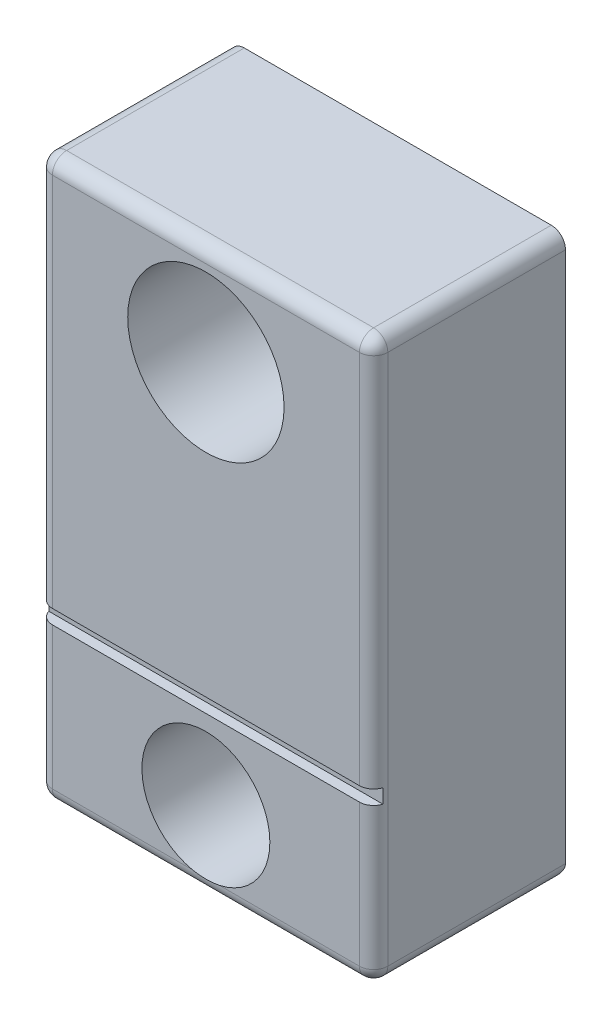
ISO-10303-21;
HEADER;
FILE_DESCRIPTION(('STEP AP214'),'2;1');
FILE_NAME('part.step','',(''),(''),'','','');
FILE_SCHEMA(('AUTOMOTIVE_DESIGN { 1 0 10303 214 1 1 1 1 }'));
ENDSEC;
DATA;
#1=APPLICATION_CONTEXT('core data for automotive mechanical design processes');
#2=APPLICATION_PROTOCOL_DEFINITION('international standard','automotive_design',2000,#1);
#3=PRODUCT_CONTEXT('',#1,'mechanical');
#4=PRODUCT('Part','Part','',(#3));
#5=PRODUCT_RELATED_PRODUCT_CATEGORY('part','',(#4));
#6=PRODUCT_DEFINITION_FORMATION('','',#4);
#7=PRODUCT_DEFINITION_CONTEXT('part definition',#1,'design');
#8=PRODUCT_DEFINITION('design','',#6,#7);
#9=PRODUCT_DEFINITION_SHAPE('','',#8);
#10=(LENGTH_UNIT() NAMED_UNIT(*) SI_UNIT(.MILLI.,.METRE.));
#11=(NAMED_UNIT(*) PLANE_ANGLE_UNIT() SI_UNIT($,.RADIAN.));
#12=(NAMED_UNIT(*) SI_UNIT($,.STERADIAN.) SOLID_ANGLE_UNIT());
#13=UNCERTAINTY_MEASURE_WITH_UNIT(LENGTH_MEASURE(1.E-05),#10,'distance_accuracy_value','');
#14=(GEOMETRIC_REPRESENTATION_CONTEXT(3) GLOBAL_UNCERTAINTY_ASSIGNED_CONTEXT((#13)) GLOBAL_UNIT_ASSIGNED_CONTEXT((#10,
#11,#12)) REPRESENTATION_CONTEXT('',''));
#15=CARTESIAN_POINT('',(0.,0.,0.));
#16=DIRECTION('',(0.,0.,1.));
#17=DIRECTION('',(1.,0.,0.));
#18=AXIS2_PLACEMENT_3D('',#15,#16,#17);
#19=CARTESIAN_POINT('',(0.,0.,1.35));
#20=DIRECTION('',(0.,0.,1.));
#21=DIRECTION('',(1.,0.,0.));
#22=AXIS2_PLACEMENT_3D('',#19,#20,#21);
#23=PLANE('',#22);
#24=CARTESIAN_POINT('',(0.,-1.43,1.35));
#25=DIRECTION('',(0.,0.,1.));
#26=DIRECTION('',(1.,0.,0.));
#27=AXIS2_PLACEMENT_3D('',#24,#25,#26);
#28=CIRCLE('',#27,0.45);
#29=CARTESIAN_POINT('',(0.0943398113205661,-1.87,1.35));
#30=VERTEX_POINT('',#29);
#31=CARTESIAN_POINT('',(-0.0943398113205653,-1.87,1.35));
#32=VERTEX_POINT('',#31);
#33=EDGE_CURVE('E60',#30,#32,#28,.T.);
#34=ORIENTED_EDGE('',*,*,#33,.F.);
#35=DIRECTION('',(1.,0.,0.));
#36=VECTOR('',#35,1.);
#37=CARTESIAN_POINT('',(1.18,-1.87,1.35));
#38=LINE('',#37,#36);
#39=CARTESIAN_POINT('',(1.08,-1.87,1.35));
#40=VERTEX_POINT('',#39);
#41=EDGE_CURVE('E158',#30,#40,#38,.T.);
#42=ORIENTED_EDGE('',*,*,#41,.T.);
#43=DIRECTION('',(0.,1.,0.));
#44=VECTOR('',#43,1.);
#45=CARTESIAN_POINT('',(1.08,-0.869999999999999,1.35));
#46=LINE('',#45,#44);
#47=CARTESIAN_POINT('',(1.08,-0.869999999999999,1.35));
#48=VERTEX_POINT('',#47);
#49=EDGE_CURVE('E174',#40,#48,#46,.T.);
#50=ORIENTED_EDGE('',*,*,#49,.T.);
#51=DIRECTION('',(1.,0.,0.));
#52=VECTOR('',#51,1.);
#53=CARTESIAN_POINT('',(-1.18,-0.87,1.35));
#54=LINE('',#53,#52);
#55=CARTESIAN_POINT('',(-1.08,-0.87,1.35));
#56=VERTEX_POINT('',#55);
#57=EDGE_CURVE('E308',#56,#48,#54,.T.);
#58=ORIENTED_EDGE('',*,*,#57,.F.);
#59=DIRECTION('',(0.,-1.,0.));
#60=VECTOR('',#59,1.);
#61=CARTESIAN_POINT('',(-1.08,-1.97,1.35));
#62=LINE('',#61,#60);
#63=CARTESIAN_POINT('',(-1.08,-1.87,1.35));
#64=VERTEX_POINT('',#63);
#65=EDGE_CURVE('E170',#56,#64,#62,.T.);
#66=ORIENTED_EDGE('',*,*,#65,.T.);
#67=EDGE_CURVE('E160',#64,#32,#38,.T.);
#68=ORIENTED_EDGE('',*,*,#67,.T.);
#69=EDGE_LOOP('',(#34,#42,#50,#58,#66,#68));
#70=FACE_BOUND('',#69,.T.);
#71=ADVANCED_FACE('F39',(#70),#23,.T.);
#72=CARTESIAN_POINT('',(1.18,1.97,1.35));
#73=DIRECTION('',(-1.,0.,0.));
#74=DIRECTION('',(0.,-1.,0.));
#75=AXIS2_PLACEMENT_3D('',#72,#73,#74);
#76=PLANE('',#75);
#77=DIRECTION('',(0.,1.,0.));
#78=VECTOR('',#77,1.);
#79=CARTESIAN_POINT('',(1.18,-1.97,1.25));
#80=LINE('',#79,#78);
#81=CARTESIAN_POINT('',(1.18,1.87,1.25));
#82=VERTEX_POINT('',#81);
#83=CARTESIAN_POINT('',(1.18,-1.87,1.25));
#84=VERTEX_POINT('',#83);
#85=EDGE_CURVE('E181',#82,#84,#80,.F.);
#86=ORIENTED_EDGE('',*,*,#85,.T.);
#87=DIRECTION('',(0.,0.,-1.));
#88=VECTOR('',#87,1.);
#89=CARTESIAN_POINT('',(1.18,-1.87,1.35));
#90=LINE('',#89,#88);
#91=CARTESIAN_POINT('',(1.18,-1.87,0.));
#92=VERTEX_POINT('',#91);
#93=EDGE_CURVE('E188',#84,#92,#90,.T.);
#94=ORIENTED_EDGE('',*,*,#93,.T.);
#95=DIRECTION('',(0.,1.,0.));
#96=VECTOR('',#95,1.);
#97=CARTESIAN_POINT('',(1.18,1.97,0.));
#98=LINE('',#97,#96);
#99=CARTESIAN_POINT('',(1.18,1.87,0.));
#100=VERTEX_POINT('',#99);
#101=EDGE_CURVE('E303',#92,#100,#98,.T.);
#102=ORIENTED_EDGE('',*,*,#101,.T.);
#103=DIRECTION('',(0.,0.,-1.));
#104=VECTOR('',#103,1.);
#105=CARTESIAN_POINT('',(1.18,1.87,1.35));
#106=LINE('',#105,#104);
#107=EDGE_CURVE('E184',#100,#82,#106,.F.);
#108=ORIENTED_EDGE('',*,*,#107,.T.);
#109=EDGE_LOOP('',(#86,#94,#102,#108));
#110=FACE_BOUND('',#109,.T.);
#111=ADVANCED_FACE('F432',(#110),#76,.F.);
#112=CARTESIAN_POINT('',(-1.18,1.97,1.35));
#113=DIRECTION('',(0.,-1.,0.));
#114=DIRECTION('',(0.,0.,-1.));
#115=AXIS2_PLACEMENT_3D('',#112,#113,#114);
#116=PLANE('',#115);
#117=DIRECTION('',(-1.,0.,0.));
#118=VECTOR('',#117,1.);
#119=CARTESIAN_POINT('',(-1.18,1.97,0.));
#120=LINE('',#119,#118);
#121=CARTESIAN_POINT('',(1.08,1.97,0.));
#122=VERTEX_POINT('',#121);
#123=CARTESIAN_POINT('',(-1.08,1.97,0.));
#124=VERTEX_POINT('',#123);
#125=EDGE_CURVE('E307',#122,#124,#120,.T.);
#126=ORIENTED_EDGE('',*,*,#125,.T.);
#127=DIRECTION('',(0.,0.,-1.));
#128=VECTOR('',#127,1.);
#129=CARTESIAN_POINT('',(-1.08,1.97,1.35));
#130=LINE('',#129,#128);
#131=CARTESIAN_POINT('',(-1.08,1.97,1.25));
#132=VERTEX_POINT('',#131);
#133=EDGE_CURVE('E206',#124,#132,#130,.F.);
#134=ORIENTED_EDGE('',*,*,#133,.T.);
#135=DIRECTION('',(-1.,0.,0.));
#136=VECTOR('',#135,1.);
#137=CARTESIAN_POINT('',(1.18,1.97,1.25));
#138=LINE('',#137,#136);
#139=CARTESIAN_POINT('',(1.08,1.97,1.25));
#140=VERTEX_POINT('',#139);
#141=EDGE_CURVE('E200',#132,#140,#138,.F.);
#142=ORIENTED_EDGE('',*,*,#141,.T.);
#143=DIRECTION('',(0.,0.,-1.));
#144=VECTOR('',#143,1.);
#145=CARTESIAN_POINT('',(1.08,1.97,1.35));
#146=LINE('',#145,#144);
#147=EDGE_CURVE('E203',#140,#122,#146,.T.);
#148=ORIENTED_EDGE('',*,*,#147,.T.);
#149=EDGE_LOOP('',(#126,#134,#142,#148));
#150=FACE_BOUND('',#149,.T.);
#151=ADVANCED_FACE('F430',(#150),#116,.F.);
#152=CARTESIAN_POINT('',(-1.18,1.97,1.35));
#153=DIRECTION('',(1.,0.,0.));
#154=DIRECTION('',(0.,1.,0.));
#155=AXIS2_PLACEMENT_3D('',#152,#153,#154);
#156=PLANE('',#155);
#157=DIRECTION('',(0.,-1.,0.));
#158=VECTOR('',#157,1.);
#159=CARTESIAN_POINT('',(-1.18,1.97,0.));
#160=LINE('',#159,#158);
#161=CARTESIAN_POINT('',(-1.18,1.87,0.));
#162=VERTEX_POINT('',#161);
#163=CARTESIAN_POINT('',(-1.18,-1.87,0.));
#164=VERTEX_POINT('',#163);
#165=EDGE_CURVE('E312',#162,#164,#160,.T.);
#166=ORIENTED_EDGE('',*,*,#165,.T.);
#167=DIRECTION('',(0.,0.,-1.));
#168=VECTOR('',#167,1.);
#169=CARTESIAN_POINT('',(-1.18,-1.87,1.35));
#170=LINE('',#169,#168);
#171=CARTESIAN_POINT('',(-1.18,-1.87,1.25));
#172=VERTEX_POINT('',#171);
#173=EDGE_CURVE('E175',#164,#172,#170,.F.);
#174=ORIENTED_EDGE('',*,*,#173,.T.);
#175=DIRECTION('',(0.,-1.,0.));
#176=VECTOR('',#175,1.);
#177=CARTESIAN_POINT('',(-1.18,1.97,1.25));
#178=LINE('',#177,#176);
#179=CARTESIAN_POINT('',(-1.18,1.87,1.25));
#180=VERTEX_POINT('',#179);
#181=EDGE_CURVE('E329',#172,#180,#178,.F.);
#182=ORIENTED_EDGE('',*,*,#181,.T.);
#183=DIRECTION('',(0.,0.,-1.));
#184=VECTOR('',#183,1.);
#185=CARTESIAN_POINT('',(-1.18,1.87,1.35));
#186=LINE('',#185,#184);
#187=EDGE_CURVE('E332',#180,#162,#186,.T.);
#188=ORIENTED_EDGE('',*,*,#187,.T.);
#189=EDGE_LOOP('',(#166,#174,#182,#188));
#190=FACE_BOUND('',#189,.T.);
#191=ADVANCED_FACE('F337',(#190),#156,.F.);
#192=CARTESIAN_POINT('',(-1.18,-1.97,1.35));
#193=DIRECTION('',(0.,1.,0.));
#194=DIRECTION('',(0.,0.,1.));
#195=AXIS2_PLACEMENT_3D('',#192,#193,#194);
#196=PLANE('',#195);
#197=DIRECTION('',(1.,0.,0.));
#198=VECTOR('',#197,1.);
#199=CARTESIAN_POINT('',(-1.18,-1.97,1.25));
#200=LINE('',#199,#198);
#201=CARTESIAN_POINT('',(1.08,-1.97,1.25));
#202=VERTEX_POINT('',#201);
#203=CARTESIAN_POINT('',(-1.08,-1.97,1.25));
#204=VERTEX_POINT('',#203);
#205=EDGE_CURVE('E322',#202,#204,#200,.F.);
#206=ORIENTED_EDGE('',*,*,#205,.T.);
#207=DIRECTION('',(0.,0.,-1.));
#208=VECTOR('',#207,1.);
#209=CARTESIAN_POINT('',(-1.08,-1.97,1.35));
#210=LINE('',#209,#208);
#211=CARTESIAN_POINT('',(-1.08,-1.97,0.1));
#212=VERTEX_POINT('',#211);
#213=EDGE_CURVE('E325',#204,#212,#210,.T.);
#214=ORIENTED_EDGE('',*,*,#213,.T.);
#215=DIRECTION('',(1.,0.,0.));
#216=VECTOR('',#215,1.);
#217=CARTESIAN_POINT('',(-1.18,-1.97,0.1));
#218=LINE('',#217,#216);
#219=CARTESIAN_POINT('',(1.08,-1.97,0.1));
#220=VERTEX_POINT('',#219);
#221=EDGE_CURVE('E316',#212,#220,#218,.T.);
#222=ORIENTED_EDGE('',*,*,#221,.T.);
#223=DIRECTION('',(0.,0.,-1.));
#224=VECTOR('',#223,1.);
#225=CARTESIAN_POINT('',(1.08,-1.97,1.35));
#226=LINE('',#225,#224);
#227=EDGE_CURVE('E319',#220,#202,#226,.F.);
#228=ORIENTED_EDGE('',*,*,#227,.T.);
#229=EDGE_LOOP('',(#206,#214,#222,#228));
#230=FACE_BOUND('',#229,.T.);
#231=ADVANCED_FACE('F348',(#230),#196,.F.);
#232=CARTESIAN_POINT('',(0.,1.27,1.35));
#233=DIRECTION('',(0.,0.,1.));
#234=DIRECTION('',(1.,0.,0.));
#235=AXIS2_PLACEMENT_3D('',#232,#233,#234);
#236=CIRCLE('',#235,0.55);
#237=CARTESIAN_POINT('',(0.55,1.27,1.35));
#238=VERTEX_POINT('',#237);
#239=EDGE_CURVE('E399',#238,#238,#236,.T.);
#240=ORIENTED_EDGE('',*,*,#239,.F.);
#241=EDGE_LOOP('',(#240));
#242=FACE_BOUND('',#241,.T.);
#243=DIRECTION('',(1.,0.,0.));
#244=VECTOR('',#243,1.);
#245=CARTESIAN_POINT('',(-1.18,-0.77,1.35));
#246=LINE('',#245,#244);
#247=CARTESIAN_POINT('',(-1.08,-0.77,1.35));
#248=VERTEX_POINT('',#247);
#249=CARTESIAN_POINT('',(1.08,-0.769999999999999,1.35));
#250=VERTEX_POINT('',#249);
#251=EDGE_CURVE('E299',#248,#250,#246,.T.);
#252=ORIENTED_EDGE('',*,*,#251,.T.);
#253=DIRECTION('',(0.,1.,0.));
#254=VECTOR('',#253,1.);
#255=CARTESIAN_POINT('',(1.08,1.97,1.35));
#256=LINE('',#255,#254);
#257=CARTESIAN_POINT('',(1.08,1.87,1.35));
#258=VERTEX_POINT('',#257);
#259=EDGE_CURVE('E215',#250,#258,#256,.T.);
#260=ORIENTED_EDGE('',*,*,#259,.T.);
#261=DIRECTION('',(-1.,0.,0.));
#262=VECTOR('',#261,1.);
#263=CARTESIAN_POINT('',(-1.18,1.87,1.35));
#264=LINE('',#263,#262);
#265=CARTESIAN_POINT('',(-1.08,1.87,1.35));
#266=VERTEX_POINT('',#265);
#267=EDGE_CURVE('E212',#258,#266,#264,.T.);
#268=ORIENTED_EDGE('',*,*,#267,.T.);
#269=DIRECTION('',(0.,-1.,0.));
#270=VECTOR('',#269,1.);
#271=CARTESIAN_POINT('',(-1.08,-0.77,1.35));
#272=LINE('',#271,#270);
#273=EDGE_CURVE('E209',#266,#248,#272,.T.);
#274=ORIENTED_EDGE('',*,*,#273,.T.);
#275=EDGE_LOOP('',(#252,#260,#268,#274));
#276=FACE_BOUND('',#275,.T.);
#277=ADVANCED_FACE('F416',(#242,#276),#23,.T.);
#278=CARTESIAN_POINT('',(0.,0.,0.));
#279=DIRECTION('',(0.,0.,1.));
#280=DIRECTION('',(1.,0.,0.));
#281=AXIS2_PLACEMENT_3D('',#278,#279,#280);
#282=PLANE('',#281);
#283=ORIENTED_EDGE('',*,*,#101,.F.);
#284=DIRECTION('',(1.,0.,0.));
#285=VECTOR('',#284,1.);
#286=CARTESIAN_POINT('',(0.,-1.87,0.));
#287=LINE('',#286,#285);
#288=EDGE_CURVE('E197',#92,#164,#287,.F.);
#289=ORIENTED_EDGE('',*,*,#288,.T.);
#290=ORIENTED_EDGE('',*,*,#165,.F.);
#291=CARTESIAN_POINT('',(-1.08,1.87,0.));
#292=DIRECTION('',(0.,0.,1.));
#293=DIRECTION('',(1.,0.,0.));
#294=AXIS2_PLACEMENT_3D('',#291,#292,#293);
#295=CIRCLE('',#294,0.1);
#296=EDGE_CURVE('E194',#162,#124,#295,.F.);
#297=ORIENTED_EDGE('',*,*,#296,.T.);
#298=ORIENTED_EDGE('',*,*,#125,.F.);
#299=CARTESIAN_POINT('',(1.08,1.87,0.));
#300=DIRECTION('',(0.,0.,1.));
#301=DIRECTION('',(1.,0.,0.));
#302=AXIS2_PLACEMENT_3D('',#299,#300,#301);
#303=CIRCLE('',#302,0.1);
#304=EDGE_CURVE('E191',#122,#100,#303,.F.);
#305=ORIENTED_EDGE('',*,*,#304,.T.);
#306=EDGE_LOOP('',(#283,#289,#290,#297,#298,#305));
#307=FACE_BOUND('',#306,.T.);
#308=ADVANCED_FACE('F370',(#307),#282,.F.);
#309=CARTESIAN_POINT('',(-1.18,-0.87,1.35));
#310=DIRECTION('',(0.,-1.,0.));
#311=DIRECTION('',(0.,0.,-1.));
#312=AXIS2_PLACEMENT_3D('',#309,#310,#311);
#313=PLANE('',#312);
#314=ORIENTED_EDGE('',*,*,#57,.T.);
#315=CARTESIAN_POINT('',(1.08,-0.87,1.25));
#316=DIRECTION('',(0.,-1.,0.));
#317=DIRECTION('',(0.,0.,-1.));
#318=AXIS2_PLACEMENT_3D('',#315,#316,#317);
#319=CIRCLE('',#318,0.1);
#320=CARTESIAN_POINT('',(1.17539392014169,-0.87,1.28));
#321=VERTEX_POINT('',#320);
#322=EDGE_CURVE('E55',#48,#321,#319,.F.);
#323=ORIENTED_EDGE('',*,*,#322,.T.);
#324=DIRECTION('',(1.,0.,0.));
#325=VECTOR('',#324,1.);
#326=CARTESIAN_POINT('',(-1.18,-0.87,1.28));
#327=LINE('',#326,#325);
#328=CARTESIAN_POINT('',(-1.17539392014169,-0.87,1.28));
#329=VERTEX_POINT('',#328);
#330=EDGE_CURVE('E285',#329,#321,#327,.T.);
#331=ORIENTED_EDGE('',*,*,#330,.F.);
#332=CARTESIAN_POINT('',(-1.08,-0.87,1.25));
#333=DIRECTION('',(0.,-1.,0.));
#334=DIRECTION('',(0.,0.,-1.));
#335=AXIS2_PLACEMENT_3D('',#332,#333,#334);
#336=CIRCLE('',#335,0.1);
#337=EDGE_CURVE('E230',#329,#56,#336,.F.);
#338=ORIENTED_EDGE('',*,*,#337,.T.);
#339=EDGE_LOOP('',(#314,#323,#331,#338));
#340=FACE_BOUND('',#339,.T.);
#341=ADVANCED_FACE('F390',(#340),#313,.F.);
#342=CARTESIAN_POINT('',(-1.18,-0.77,1.28));
#343=DIRECTION('',(0.,1.,0.));
#344=DIRECTION('',(0.,0.,1.));
#345=AXIS2_PLACEMENT_3D('',#342,#343,#344);
#346=PLANE('',#345);
#347=DIRECTION('',(1.,0.,0.));
#348=VECTOR('',#347,1.);
#349=CARTESIAN_POINT('',(-1.18,-0.77,1.28));
#350=LINE('',#349,#348);
#351=CARTESIAN_POINT('',(-1.17539392014169,-0.77,1.28));
#352=VERTEX_POINT('',#351);
#353=CARTESIAN_POINT('',(1.17539392014169,-0.769999999999999,1.28));
#354=VERTEX_POINT('',#353);
#355=EDGE_CURVE('E292',#352,#354,#350,.T.);
#356=ORIENTED_EDGE('',*,*,#355,.T.);
#357=CARTESIAN_POINT('',(1.08,-0.769999999999999,1.25));
#358=DIRECTION('',(0.,1.,0.));
#359=DIRECTION('',(0.,0.,1.));
#360=AXIS2_PLACEMENT_3D('',#357,#358,#359);
#361=CIRCLE('',#360,0.1);
#362=EDGE_CURVE('E227',#354,#250,#361,.F.);
#363=ORIENTED_EDGE('',*,*,#362,.T.);
#364=ORIENTED_EDGE('',*,*,#251,.F.);
#365=CARTESIAN_POINT('',(-1.08,-0.77,1.25));
#366=DIRECTION('',(0.,1.,0.));
#367=DIRECTION('',(0.,0.,1.));
#368=AXIS2_PLACEMENT_3D('',#365,#366,#367);
#369=CIRCLE('',#368,0.1);
#370=EDGE_CURVE('E224',#248,#352,#369,.F.);
#371=ORIENTED_EDGE('',*,*,#370,.T.);
#372=EDGE_LOOP('',(#356,#363,#364,#371));
#373=FACE_BOUND('',#372,.T.);
#374=ADVANCED_FACE('F471',(#373),#346,.F.);
#375=CARTESIAN_POINT('',(-1.18,-0.87,1.28));
#376=DIRECTION('',(0.,0.,-1.));
#377=DIRECTION('',(-1.,0.,0.));
#378=AXIS2_PLACEMENT_3D('',#375,#376,#377);
#379=PLANE('',#378);
#380=DIRECTION('',(0.,-1.,0.));
#381=VECTOR('',#380,1.);
#382=CARTESIAN_POINT('',(1.17539392014169,-0.87,1.28));
#383=LINE('',#382,#381);
#384=EDGE_CURVE('E221',#321,#354,#383,.F.);
#385=ORIENTED_EDGE('',*,*,#384,.T.);
#386=ORIENTED_EDGE('',*,*,#355,.F.);
#387=DIRECTION('',(0.,1.,0.));
#388=VECTOR('',#387,1.);
#389=CARTESIAN_POINT('',(-1.17539392014169,-0.77,1.28));
#390=LINE('',#389,#388);
#391=EDGE_CURVE('E218',#352,#329,#390,.F.);
#392=ORIENTED_EDGE('',*,*,#391,.T.);
#393=ORIENTED_EDGE('',*,*,#330,.T.);
#394=EDGE_LOOP('',(#385,#386,#392,#393));
#395=FACE_BOUND('',#394,.T.);
#396=ADVANCED_FACE('F467',(#395),#379,.F.);
#397=CARTESIAN_POINT('',(1.08,1.87,1.35));
#398=DIRECTION('',(0.,0.,-1.));
#399=DIRECTION('',(-1.,0.,0.));
#400=AXIS2_PLACEMENT_3D('',#397,#398,#399);
#401=CYLINDRICAL_SURFACE('',#400,0.1);
#402=CARTESIAN_POINT('',(1.08,1.87,1.25));
#403=DIRECTION('',(0.,0.,1.));
#404=DIRECTION('',(1.,0.,0.));
#405=AXIS2_PLACEMENT_3D('',#402,#403,#404);
#406=CIRCLE('',#405,0.1);
#407=EDGE_CURVE('E282',#82,#140,#406,.T.);
#408=ORIENTED_EDGE('',*,*,#407,.F.);
#409=ORIENTED_EDGE('',*,*,#107,.F.);
#410=ORIENTED_EDGE('',*,*,#304,.F.);
#411=ORIENTED_EDGE('',*,*,#147,.F.);
#412=EDGE_LOOP('',(#408,#409,#410,#411));
#413=FACE_BOUND('',#412,.T.);
#414=ADVANCED_FACE('F41',(#413),#401,.T.);
#415=CARTESIAN_POINT('',(1.08,1.87,1.25));
#416=DIRECTION('',(0.,1.,0.));
#417=DIRECTION('',(-1.,0.,0.));
#418=AXIS2_PLACEMENT_3D('',#415,#416,#417);
#419=SPHERICAL_SURFACE('',#418,0.1);
#420=CARTESIAN_POINT('',(1.08,1.87,1.25));
#421=DIRECTION('',(0.,1.,0.));
#422=DIRECTION('',(0.,0.,1.));
#423=AXIS2_PLACEMENT_3D('',#420,#421,#422);
#424=CIRCLE('',#423,0.1);
#425=EDGE_CURVE('E275',#82,#258,#424,.F.);
#426=ORIENTED_EDGE('',*,*,#425,.F.);
#427=ORIENTED_EDGE('',*,*,#407,.T.);
#428=CARTESIAN_POINT('',(1.08,1.87,1.25));
#429=DIRECTION('',(1.,0.,0.));
#430=DIRECTION('',(0.,0.,-1.));
#431=AXIS2_PLACEMENT_3D('',#428,#429,#430);
#432=CIRCLE('',#431,0.1);
#433=EDGE_CURVE('E279',#258,#140,#432,.F.);
#434=ORIENTED_EDGE('',*,*,#433,.F.);
#435=EDGE_LOOP('',(#426,#427,#434));
#436=FACE_BOUND('',#435,.T.);
#437=ADVANCED_FACE('F424',(#436),#419,.T.);
#438=CARTESIAN_POINT('',(-1.08,1.87,1.35));
#439=DIRECTION('',(0.,0.,-1.));
#440=DIRECTION('',(-1.,0.,0.));
#441=AXIS2_PLACEMENT_3D('',#438,#439,#440);
#442=CYLINDRICAL_SURFACE('',#441,0.1);
#443=ORIENTED_EDGE('',*,*,#296,.F.);
#444=ORIENTED_EDGE('',*,*,#187,.F.);
#445=CARTESIAN_POINT('',(-1.08,1.87,1.25));
#446=DIRECTION('',(0.,0.,1.));
#447=DIRECTION('',(1.,0.,0.));
#448=AXIS2_PLACEMENT_3D('',#445,#446,#447);
#449=CIRCLE('',#448,0.1);
#450=EDGE_CURVE('E271',#132,#180,#449,.T.);
#451=ORIENTED_EDGE('',*,*,#450,.F.);
#452=ORIENTED_EDGE('',*,*,#133,.F.);
#453=EDGE_LOOP('',(#443,#444,#451,#452));
#454=FACE_BOUND('',#453,.T.);
#455=ADVANCED_FACE('F367',(#454),#442,.T.);
#456=CARTESIAN_POINT('',(0.,1.87,1.25));
#457=DIRECTION('',(1.,0.,0.));
#458=DIRECTION('',(0.,0.,-1.));
#459=AXIS2_PLACEMENT_3D('',#456,#457,#458);
#460=CYLINDRICAL_SURFACE('',#459,0.1);
#461=ORIENTED_EDGE('',*,*,#433,.T.);
#462=ORIENTED_EDGE('',*,*,#141,.F.);
#463=CARTESIAN_POINT('',(-1.08,1.87,1.25));
#464=DIRECTION('',(-1.,0.,0.));
#465=DIRECTION('',(0.,0.,1.));
#466=AXIS2_PLACEMENT_3D('',#463,#464,#465);
#467=CIRCLE('',#466,0.1);
#468=EDGE_CURVE('E267',#266,#132,#467,.T.);
#469=ORIENTED_EDGE('',*,*,#468,.F.);
#470=ORIENTED_EDGE('',*,*,#267,.F.);
#471=EDGE_LOOP('',(#461,#462,#469,#470));
#472=FACE_BOUND('',#471,.T.);
#473=ADVANCED_FACE('F427',(#472),#460,.T.);
#474=CARTESIAN_POINT('',(1.08,0.,1.25));
#475=DIRECTION('',(0.,-1.,0.));
#476=DIRECTION('',(1.,0.,0.));
#477=AXIS2_PLACEMENT_3D('',#474,#475,#476);
#478=CYLINDRICAL_SURFACE('',#477,0.1);
#479=ORIENTED_EDGE('',*,*,#362,.F.);
#480=ORIENTED_EDGE('',*,*,#384,.F.);
#481=ORIENTED_EDGE('',*,*,#322,.F.);
#482=ORIENTED_EDGE('',*,*,#49,.F.);
#483=CARTESIAN_POINT('',(1.08,-1.87,1.25));
#484=DIRECTION('',(0.,-1.,0.));
#485=DIRECTION('',(0.,0.,-1.));
#486=AXIS2_PLACEMENT_3D('',#483,#484,#485);
#487=CIRCLE('',#486,0.1);
#488=EDGE_CURVE('E260',#84,#40,#487,.T.);
#489=ORIENTED_EDGE('',*,*,#488,.F.);
#490=ORIENTED_EDGE('',*,*,#85,.F.);
#491=ORIENTED_EDGE('',*,*,#425,.T.);
#492=ORIENTED_EDGE('',*,*,#259,.F.);
#493=EDGE_LOOP('',(#479,#480,#481,#482,#489,#490,#491,#492));
#494=FACE_BOUND('',#493,.T.);
#495=ADVANCED_FACE('F386',(#494),#478,.T.);
#496=CARTESIAN_POINT('',(-1.08,1.87,1.25));
#497=DIRECTION('',(0.,1.,0.));
#498=DIRECTION('',(0.,0.,1.));
#499=AXIS2_PLACEMENT_3D('',#496,#497,#498);
#500=SPHERICAL_SURFACE('',#499,0.1);
#501=ORIENTED_EDGE('',*,*,#468,.T.);
#502=ORIENTED_EDGE('',*,*,#450,.T.);
#503=CARTESIAN_POINT('',(-1.08,1.87,1.25));
#504=DIRECTION('',(0.,1.,0.));
#505=DIRECTION('',(0.,0.,1.));
#506=AXIS2_PLACEMENT_3D('',#503,#504,#505);
#507=CIRCLE('',#506,0.1);
#508=EDGE_CURVE('E263',#266,#180,#507,.F.);
#509=ORIENTED_EDGE('',*,*,#508,.F.);
#510=EDGE_LOOP('',(#501,#502,#509));
#511=FACE_BOUND('',#510,.T.);
#512=ADVANCED_FACE('F361',(#511),#500,.T.);
#513=CARTESIAN_POINT('',(-1.08,0.,1.25));
#514=DIRECTION('',(0.,1.,0.));
#515=DIRECTION('',(-1.,0.,0.));
#516=AXIS2_PLACEMENT_3D('',#513,#514,#515);
#517=CYLINDRICAL_SURFACE('',#516,0.1);
#518=ORIENTED_EDGE('',*,*,#508,.T.);
#519=ORIENTED_EDGE('',*,*,#181,.F.);
#520=CARTESIAN_POINT('',(-1.08,-1.87,1.25));
#521=DIRECTION('',(0.,-1.,0.));
#522=DIRECTION('',(0.,0.,-1.));
#523=AXIS2_PLACEMENT_3D('',#520,#521,#522);
#524=CIRCLE('',#523,0.1);
#525=EDGE_CURVE('E250',#64,#172,#524,.T.);
#526=ORIENTED_EDGE('',*,*,#525,.F.);
#527=ORIENTED_EDGE('',*,*,#65,.F.);
#528=ORIENTED_EDGE('',*,*,#337,.F.);
#529=ORIENTED_EDGE('',*,*,#391,.F.);
#530=ORIENTED_EDGE('',*,*,#370,.F.);
#531=ORIENTED_EDGE('',*,*,#273,.F.);
#532=EDGE_LOOP('',(#518,#519,#526,#527,#528,#529,#530,#531));
#533=FACE_BOUND('',#532,.T.);
#534=ADVANCED_FACE('F355',(#533),#517,.T.);
#535=CARTESIAN_POINT('',(1.08,-1.87,1.25));
#536=DIRECTION('',(0.,0.,1.));
#537=DIRECTION('',(1.,0.,0.));
#538=AXIS2_PLACEMENT_3D('',#535,#536,#537);
#539=SPHERICAL_SURFACE('',#538,0.1);
#540=CARTESIAN_POINT('',(1.08,-1.87,1.25));
#541=DIRECTION('',(0.,0.,1.));
#542=DIRECTION('',(1.,0.,0.));
#543=AXIS2_PLACEMENT_3D('',#540,#541,#542);
#544=CIRCLE('',#543,0.1);
#545=EDGE_CURVE('E254',#84,#202,#544,.F.);
#546=ORIENTED_EDGE('',*,*,#545,.F.);
#547=ORIENTED_EDGE('',*,*,#488,.T.);
#548=CARTESIAN_POINT('',(1.08,-1.87,1.25));
#549=DIRECTION('',(1.,0.,0.));
#550=DIRECTION('',(0.,0.,-1.));
#551=AXIS2_PLACEMENT_3D('',#548,#549,#550);
#552=CIRCLE('',#551,0.1);
#553=EDGE_CURVE('E167',#202,#40,#552,.F.);
#554=ORIENTED_EDGE('',*,*,#553,.F.);
#555=EDGE_LOOP('',(#546,#547,#554));
#556=FACE_BOUND('',#555,.T.);
#557=ADVANCED_FACE('F380',(#556),#539,.T.);
#558=CARTESIAN_POINT('',(0.,-1.87,1.25));
#559=DIRECTION('',(-1.,0.,0.));
#560=DIRECTION('',(0.,0.,1.));
#561=AXIS2_PLACEMENT_3D('',#558,#559,#560);
#562=CYLINDRICAL_SURFACE('',#561,0.1);
#563=CARTESIAN_POINT('',(-0.0943398113205653,-1.87,1.35));
#564=CARTESIAN_POINT('',(-0.0818799439583909,-1.87267294866338,1.34998188467738));
#565=CARTESIAN_POINT('',(-0.0693063234067325,-1.87481385554813,1.34989211316696));
#566=CARTESIAN_POINT('',(-0.0440162915768007,-1.87802318703776,1.34969549006814));
#567=CARTESIAN_POINT('',(-0.0312998086529087,-1.87909104678763,1.34958862951828));
#568=CARTESIAN_POINT('',(-0.00604372922089295,-1.88013390037375,1.34948525284438));
#569=CARTESIAN_POINT('',(0.00649509502897815,-1.88012758692873,1.34948684906457));
#570=CARTESIAN_POINT('',(0.0315212649512798,-1.8790691415653,1.34958973382835));
#571=CARTESIAN_POINT('',(0.0440086390971613,-1.8780176986777,1.34969095668987));
#572=CARTESIAN_POINT('',(0.0627744078817509,-1.87564597800755,1.3498434758531));
#573=CARTESIAN_POINT('',(0.0691033698367969,-1.87470850267361,1.34989498475258));
#574=CARTESIAN_POINT('',(0.0817442859362543,-1.87255976875647,1.34997290162698));
#575=CARTESIAN_POINT('',(0.0880560331964321,-1.87134728930553,1.34999919485047));
#576=CARTESIAN_POINT('',(0.0943398113205661,-1.87,1.35));
#577=B_SPLINE_CURVE_WITH_KNOTS('',3,(#563,#564,#565,#566,#567,#568,#569,#570,#571,#572,#573,
#574,#575,#576),.UNSPECIFIED.,.F.,.F.,(4,2,2,2,2,2,4),(0.,0.0382184976447295,0.0764571030909748,
0.114030351114211,0.151578844341887,0.170768437065823,0.190044949057373),.UNSPECIFIED.);
#578=EDGE_CURVE('E11',#32,#30,#577,.T.);
#579=ORIENTED_EDGE('',*,*,#578,.F.);
#580=ORIENTED_EDGE('',*,*,#67,.F.);
#581=CARTESIAN_POINT('',(-1.08,-1.87,1.25));
#582=DIRECTION('',(-1.,0.,0.));
#583=DIRECTION('',(0.,0.,1.));
#584=AXIS2_PLACEMENT_3D('',#581,#582,#583);
#585=CIRCLE('',#584,0.1);
#586=EDGE_CURVE('E246',#204,#64,#585,.T.);
#587=ORIENTED_EDGE('',*,*,#586,.F.);
#588=ORIENTED_EDGE('',*,*,#205,.F.);
#589=ORIENTED_EDGE('',*,*,#553,.T.);
#590=ORIENTED_EDGE('',*,*,#41,.F.);
#591=EDGE_LOOP('',(#579,#580,#587,#588,#589,#590));
#592=FACE_BOUND('',#591,.T.);
#593=ADVANCED_FACE('F164',(#592),#562,.T.);
#594=CARTESIAN_POINT('',(1.08,-1.87,1.35));
#595=DIRECTION('',(0.,0.,-1.));
#596=DIRECTION('',(-1.,0.,0.));
#597=AXIS2_PLACEMENT_3D('',#594,#595,#596);
#598=CYLINDRICAL_SURFACE('',#597,0.1);
#599=ORIENTED_EDGE('',*,*,#545,.T.);
#600=ORIENTED_EDGE('',*,*,#227,.F.);
#601=CARTESIAN_POINT('',(1.08,-1.87,0.1));
#602=DIRECTION('',(0.707106781186547,0.,0.707106781186547));
#603=DIRECTION('',(0.707106781186547,0.,-0.707106781186547));
#604=AXIS2_PLACEMENT_3D('',#601,#602,#603);
#605=ELLIPSE('',#604,0.14142135623731,0.1);
#606=EDGE_CURVE('E242',#92,#220,#605,.F.);
#607=ORIENTED_EDGE('',*,*,#606,.F.);
#608=ORIENTED_EDGE('',*,*,#93,.F.);
#609=EDGE_LOOP('',(#599,#600,#607,#608));
#610=FACE_BOUND('',#609,.T.);
#611=ADVANCED_FACE('F377',(#610),#598,.T.);
#612=CARTESIAN_POINT('',(-1.08,-1.87,1.25));
#613=DIRECTION('',(0.,0.,1.));
#614=DIRECTION('',(1.,0.,0.));
#615=AXIS2_PLACEMENT_3D('',#612,#613,#614);
#616=SPHERICAL_SURFACE('',#615,0.1);
#617=ORIENTED_EDGE('',*,*,#586,.T.);
#618=ORIENTED_EDGE('',*,*,#525,.T.);
#619=CARTESIAN_POINT('',(-1.08,-1.87,1.25));
#620=DIRECTION('',(0.,0.,1.));
#621=DIRECTION('',(1.,0.,0.));
#622=AXIS2_PLACEMENT_3D('',#619,#620,#621);
#623=CIRCLE('',#622,0.1);
#624=EDGE_CURVE('E237',#204,#172,#623,.F.);
#625=ORIENTED_EDGE('',*,*,#624,.F.);
#626=EDGE_LOOP('',(#617,#618,#625));
#627=FACE_BOUND('',#626,.T.);
#628=ADVANCED_FACE('F352',(#627),#616,.T.);
#629=CARTESIAN_POINT('',(-1.18,-1.87,0.1));
#630=DIRECTION('',(1.,0.,0.));
#631=DIRECTION('',(0.,0.,-1.));
#632=AXIS2_PLACEMENT_3D('',#629,#630,#631);
#633=CYLINDRICAL_SURFACE('',#632,0.1);
#634=ORIENTED_EDGE('',*,*,#606,.T.);
#635=ORIENTED_EDGE('',*,*,#221,.F.);
#636=CARTESIAN_POINT('',(-1.08,-1.87,0.1));
#637=DIRECTION('',(0.707106781186547,0.,-0.707106781186547));
#638=DIRECTION('',(0.707106781186547,0.,0.707106781186547));
#639=AXIS2_PLACEMENT_3D('',#636,#637,#638);
#640=ELLIPSE('',#639,0.14142135623731,0.1);
#641=EDGE_CURVE('E149',#164,#212,#640,.F.);
#642=ORIENTED_EDGE('',*,*,#641,.F.);
#643=ORIENTED_EDGE('',*,*,#288,.F.);
#644=EDGE_LOOP('',(#634,#635,#642,#643));
#645=FACE_BOUND('',#644,.T.);
#646=ADVANCED_FACE('F344',(#645),#633,.T.);
#647=CARTESIAN_POINT('',(-1.08,-1.87,1.35));
#648=DIRECTION('',(0.,0.,-1.));
#649=DIRECTION('',(-1.,0.,0.));
#650=AXIS2_PLACEMENT_3D('',#647,#648,#649);
#651=CYLINDRICAL_SURFACE('',#650,0.1);
#652=ORIENTED_EDGE('',*,*,#624,.T.);
#653=ORIENTED_EDGE('',*,*,#173,.F.);
#654=ORIENTED_EDGE('',*,*,#641,.T.);
#655=ORIENTED_EDGE('',*,*,#213,.F.);
#656=EDGE_LOOP('',(#652,#653,#654,#655));
#657=FACE_BOUND('',#656,.T.);
#658=ADVANCED_FACE('F340',(#657),#651,.T.);
#659=CARTESIAN_POINT('',(0.,-1.43,0.35));
#660=DIRECTION('',(0.,0.,1.));
#661=DIRECTION('',(1.,0.,0.));
#662=AXIS2_PLACEMENT_3D('',#659,#660,#661);
#663=CYLINDRICAL_SURFACE('',#662,0.45);
#664=ORIENTED_EDGE('',*,*,#578,.T.);
#665=ORIENTED_EDGE('',*,*,#33,.T.);
#666=EDGE_LOOP('',(#664,#665));
#667=FACE_BOUND('',#666,.T.);
#668=CARTESIAN_POINT('',(0.,-1.43,0.35));
#669=DIRECTION('',(0.,0.,1.));
#670=DIRECTION('',(1.,0.,0.));
#671=AXIS2_PLACEMENT_3D('',#668,#669,#670);
#672=CIRCLE('',#671,0.45);
#673=CARTESIAN_POINT('',(0.45,-1.43,0.35));
#674=VERTEX_POINT('',#673);
#675=EDGE_CURVE('E162',#674,#674,#672,.T.);
#676=ORIENTED_EDGE('',*,*,#675,.F.);
#677=EDGE_LOOP('',(#676));
#678=FACE_BOUND('',#677,.T.);
#679=ADVANCED_FACE('F151',(#667,#678),#663,.F.);
#680=CARTESIAN_POINT('',(0.,-1.43,0.35));
#681=DIRECTION('',(0.,0.,1.));
#682=DIRECTION('',(1.,0.,0.));
#683=AXIS2_PLACEMENT_3D('',#680,#681,#682);
#684=PLANE('',#683);
#685=ORIENTED_EDGE('',*,*,#675,.T.);
#686=EDGE_LOOP('',(#685));
#687=FACE_BOUND('',#686,.T.);
#688=ADVANCED_FACE('F412',(#687),#684,.T.);
#689=CARTESIAN_POINT('',(0.,1.27,0.35));
#690=DIRECTION('',(0.,0.,1.));
#691=DIRECTION('',(1.,0.,0.));
#692=AXIS2_PLACEMENT_3D('',#689,#690,#691);
#693=CYLINDRICAL_SURFACE('',#692,0.55);
#694=CARTESIAN_POINT('',(0.,1.27,0.35));
#695=DIRECTION('',(0.,0.,1.));
#696=DIRECTION('',(1.,0.,0.));
#697=AXIS2_PLACEMENT_3D('',#694,#695,#696);
#698=CIRCLE('',#697,0.55);
#699=CARTESIAN_POINT('',(0.55,1.27,0.35));
#700=VERTEX_POINT('',#699);
#701=EDGE_CURVE('E238',#700,#700,#698,.T.);
#702=ORIENTED_EDGE('',*,*,#701,.F.);
#703=EDGE_LOOP('',(#702));
#704=FACE_BOUND('',#703,.T.);
#705=ORIENTED_EDGE('',*,*,#239,.T.);
#706=EDGE_LOOP('',(#705));
#707=FACE_BOUND('',#706,.T.);
#708=ADVANCED_FACE('F409',(#704,#707),#693,.F.);
#709=CARTESIAN_POINT('',(0.,1.27,0.35));
#710=DIRECTION('',(0.,0.,1.));
#711=DIRECTION('',(1.,0.,0.));
#712=AXIS2_PLACEMENT_3D('',#709,#710,#711);
#713=PLANE('',#712);
#714=ORIENTED_EDGE('',*,*,#701,.T.);
#715=EDGE_LOOP('',(#714));
#716=FACE_BOUND('',#715,.T.);
#717=ADVANCED_FACE('F407',(#716),#713,.T.);
#718=CLOSED_SHELL('',(#71,#111,#151,#191,#231,#277,#308,#341,#374,#396,#414,#437,#455,#473,#495,
#512,#534,#557,#593,#611,#628,#646,#658,#679,#688,#708,#717));
#719=MANIFOLD_SOLID_BREP('B2',#718);
#720=ADVANCED_BREP_SHAPE_REPRESENTATION('',(#18,#719),#14);
#721=SHAPE_DEFINITION_REPRESENTATION(#9,#720);
ENDSEC;
END-ISO-10303-21;
